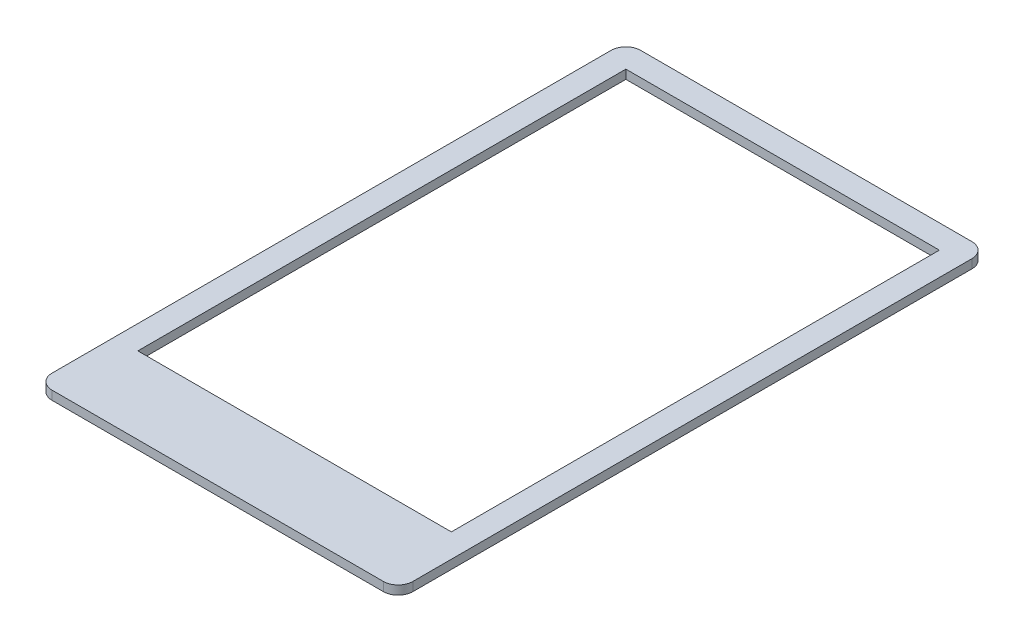
ISO-10303-21;
HEADER;
FILE_DESCRIPTION(('STEP AP214'),'2;1');
FILE_NAME('part.step','',(''),(''),'','','');
FILE_SCHEMA(('AUTOMOTIVE_DESIGN { 1 0 10303 214 1 1 1 1 }'));
ENDSEC;
DATA;
#1=APPLICATION_CONTEXT('core data for automotive mechanical design processes');
#2=APPLICATION_PROTOCOL_DEFINITION('international standard','automotive_design',2000,#1);
#3=PRODUCT_CONTEXT('',#1,'mechanical');
#4=PRODUCT('Part','Part','',(#3));
#5=PRODUCT_RELATED_PRODUCT_CATEGORY('part','',(#4));
#6=PRODUCT_DEFINITION_FORMATION('','',#4);
#7=PRODUCT_DEFINITION_CONTEXT('part definition',#1,'design');
#8=PRODUCT_DEFINITION('design','',#6,#7);
#9=PRODUCT_DEFINITION_SHAPE('','',#8);
#10=(LENGTH_UNIT() NAMED_UNIT(*) SI_UNIT(.MILLI.,.METRE.));
#11=(NAMED_UNIT(*) PLANE_ANGLE_UNIT() SI_UNIT($,.RADIAN.));
#12=(NAMED_UNIT(*) SI_UNIT($,.STERADIAN.) SOLID_ANGLE_UNIT());
#13=UNCERTAINTY_MEASURE_WITH_UNIT(LENGTH_MEASURE(1.E-05),#10,'distance_accuracy_value','');
#14=(GEOMETRIC_REPRESENTATION_CONTEXT(3) GLOBAL_UNCERTAINTY_ASSIGNED_CONTEXT((#13)) GLOBAL_UNIT_ASSIGNED_CONTEXT((#10,
#11,#12)) REPRESENTATION_CONTEXT('',''));
#15=CARTESIAN_POINT('',(0.,0.,0.));
#16=DIRECTION('',(0.,0.,1.));
#17=DIRECTION('',(1.,0.,0.));
#18=AXIS2_PLACEMENT_3D('',#15,#16,#17);
#19=CARTESIAN_POINT('',(0.,-1.,0.));
#20=DIRECTION('',(0.,-1.,0.));
#21=DIRECTION('',(0.,0.,-1.));
#22=AXIS2_PLACEMENT_3D('',#19,#20,#21);
#23=PLANE('',#22);
#24=CARTESIAN_POINT('',(58.5,-1.,-84.5));
#25=DIRECTION('',(0.,1.,0.));
#26=DIRECTION('',(0.,0.,1.));
#27=AXIS2_PLACEMENT_3D('',#24,#25,#26);
#28=CIRCLE('',#27,2.);
#29=CARTESIAN_POINT('',(58.5,-1.,-82.5));
#30=VERTEX_POINT('',#29);
#31=EDGE_CURVE('E800',#30,#30,#28,.T.);
#32=ORIENTED_EDGE('',*,*,#31,.T.);
#33=EDGE_LOOP('',(#32));
#34=FACE_BOUND('',#33,.T.);
#35=CARTESIAN_POINT('',(-58.5,-1.,-84.5));
#36=DIRECTION('',(0.,1.,0.));
#37=DIRECTION('',(0.,0.,1.));
#38=AXIS2_PLACEMENT_3D('',#35,#36,#37);
#39=CIRCLE('',#38,2.);
#40=CARTESIAN_POINT('',(-58.5,-1.,-82.5));
#41=VERTEX_POINT('',#40);
#42=EDGE_CURVE('E801',#41,#41,#39,.T.);
#43=ORIENTED_EDGE('',*,*,#42,.T.);
#44=EDGE_LOOP('',(#43));
#45=FACE_BOUND('',#44,.T.);
#46=CARTESIAN_POINT('',(-58.5,-1.,0.));
#47=DIRECTION('',(0.,1.,0.));
#48=DIRECTION('',(0.,0.,1.));
#49=AXIS2_PLACEMENT_3D('',#46,#47,#48);
#50=CIRCLE('',#49,2.);
#51=CARTESIAN_POINT('',(-58.5,-1.,2.));
#52=VERTEX_POINT('',#51);
#53=EDGE_CURVE('E813',#52,#52,#50,.T.);
#54=ORIENTED_EDGE('',*,*,#53,.T.);
#55=EDGE_LOOP('',(#54));
#56=FACE_BOUND('',#55,.T.);
#57=CARTESIAN_POINT('',(-58.5,-1.,102.5));
#58=DIRECTION('',(0.,1.,0.));
#59=DIRECTION('',(0.,0.,1.));
#60=AXIS2_PLACEMENT_3D('',#57,#58,#59);
#61=CIRCLE('',#60,2.);
#62=CARTESIAN_POINT('',(-58.5,-1.,104.5));
#63=VERTEX_POINT('',#62);
#64=EDGE_CURVE('E819',#63,#63,#61,.T.);
#65=ORIENTED_EDGE('',*,*,#64,.T.);
#66=EDGE_LOOP('',(#65));
#67=FACE_BOUND('',#66,.T.);
#68=CARTESIAN_POINT('',(58.5,-1.,102.5));
#69=DIRECTION('',(0.,1.,0.));
#70=DIRECTION('',(0.,0.,1.));
#71=AXIS2_PLACEMENT_3D('',#68,#69,#70);
#72=CIRCLE('',#71,2.);
#73=CARTESIAN_POINT('',(58.5,-1.,104.5));
#74=VERTEX_POINT('',#73);
#75=EDGE_CURVE('E825',#74,#74,#72,.T.);
#76=ORIENTED_EDGE('',*,*,#75,.T.);
#77=EDGE_LOOP('',(#76));
#78=FACE_BOUND('',#77,.T.);
#79=CARTESIAN_POINT('',(58.5,-1.,0.));
#80=DIRECTION('',(0.,1.,0.));
#81=DIRECTION('',(0.,0.,1.));
#82=AXIS2_PLACEMENT_3D('',#79,#80,#81);
#83=CIRCLE('',#82,2.);
#84=CARTESIAN_POINT('',(58.5,-1.,2.));
#85=VERTEX_POINT('',#84);
#86=EDGE_CURVE('E231',#85,#85,#83,.T.);
#87=ORIENTED_EDGE('',*,*,#86,.T.);
#88=EDGE_LOOP('',(#87));
#89=FACE_BOUND('',#88,.T.);
#90=CARTESIAN_POINT('',(-56.,-1.,-85.5));
#91=DIRECTION('',(0.,-1.,0.));
#92=DIRECTION('',(0.,0.,-1.));
#93=AXIS2_PLACEMENT_3D('',#90,#91,#92);
#94=CIRCLE('',#93,5.00000000000002);
#95=CARTESIAN_POINT('',(-56.,-1.,-90.5));
#96=VERTEX_POINT('',#95);
#97=CARTESIAN_POINT('',(-61.,-1.,-85.5));
#98=VERTEX_POINT('',#97);
#99=EDGE_CURVE('E366',#96,#98,#94,.F.);
#100=ORIENTED_EDGE('',*,*,#99,.F.);
#101=DIRECTION('',(-1.,0.,0.));
#102=VECTOR('',#101,1.);
#103=CARTESIAN_POINT('',(56.,-1.,-90.5));
#104=LINE('',#103,#102);
#105=CARTESIAN_POINT('',(56.,-1.,-90.5));
#106=VERTEX_POINT('',#105);
#107=EDGE_CURVE('E364',#106,#96,#104,.T.);
#108=ORIENTED_EDGE('',*,*,#107,.F.);
#109=CARTESIAN_POINT('',(56.,-1.,-85.5));
#110=DIRECTION('',(0.,-1.,0.));
#111=DIRECTION('',(0.,0.,-1.));
#112=AXIS2_PLACEMENT_3D('',#109,#110,#111);
#113=CIRCLE('',#112,5.);
#114=CARTESIAN_POINT('',(61.,-1.,-85.5));
#115=VERTEX_POINT('',#114);
#116=EDGE_CURVE('E362',#115,#106,#113,.F.);
#117=ORIENTED_EDGE('',*,*,#116,.F.);
#118=DIRECTION('',(0.,0.,-1.));
#119=VECTOR('',#118,1.);
#120=CARTESIAN_POINT('',(61.,-1.,85.5));
#121=LINE('',#120,#119);
#122=CARTESIAN_POINT('',(61.,-1.,103.5));
#123=VERTEX_POINT('',#122);
#124=EDGE_CURVE('E360',#123,#115,#121,.T.);
#125=ORIENTED_EDGE('',*,*,#124,.F.);
#126=CARTESIAN_POINT('',(56.,-1.,103.5));
#127=DIRECTION('',(0.,-1.,0.));
#128=DIRECTION('',(0.,0.,-1.));
#129=AXIS2_PLACEMENT_3D('',#126,#127,#128);
#130=CIRCLE('',#129,5.);
#131=CARTESIAN_POINT('',(56.,-1.,108.5));
#132=VERTEX_POINT('',#131);
#133=EDGE_CURVE('E358',#132,#123,#130,.F.);
#134=ORIENTED_EDGE('',*,*,#133,.F.);
#135=DIRECTION('',(1.,0.,0.));
#136=VECTOR('',#135,1.);
#137=CARTESIAN_POINT('',(-56.,-1.,108.5));
#138=LINE('',#137,#136);
#139=CARTESIAN_POINT('',(-56.,-1.,108.5));
#140=VERTEX_POINT('',#139);
#141=EDGE_CURVE('E356',#140,#132,#138,.T.);
#142=ORIENTED_EDGE('',*,*,#141,.F.);
#143=CARTESIAN_POINT('',(-56.,-1.,103.5));
#144=DIRECTION('',(0.,-1.,0.));
#145=DIRECTION('',(0.,0.,-1.));
#146=AXIS2_PLACEMENT_3D('',#143,#144,#145);
#147=CIRCLE('',#146,5.);
#148=CARTESIAN_POINT('',(-61.,-1.,103.5));
#149=VERTEX_POINT('',#148);
#150=EDGE_CURVE('E353',#149,#140,#147,.F.);
#151=ORIENTED_EDGE('',*,*,#150,.F.);
#152=DIRECTION('',(0.,0.,-1.));
#153=VECTOR('',#152,1.);
#154=CARTESIAN_POINT('',(-61.,-1.,-80.5));
#155=LINE('',#154,#153);
#156=EDGE_CURVE('E299',#149,#98,#155,.T.);
#157=ORIENTED_EDGE('',*,*,#156,.T.);
#158=EDGE_LOOP('',(#100,#108,#117,#125,#134,#142,#151,#157));
#159=FACE_BOUND('',#158,.T.);
#160=DIRECTION('',(0.,0.,-1.));
#161=VECTOR('',#160,1.);
#162=CARTESIAN_POINT('',(53.,-1.,82.5));
#163=LINE('',#162,#161);
#164=CARTESIAN_POINT('',(53.,-1.,82.5));
#165=VERTEX_POINT('',#164);
#166=CARTESIAN_POINT('',(53.,-1.,-82.5));
#167=VERTEX_POINT('',#166);
#168=EDGE_CURVE('E328',#165,#167,#163,.T.);
#169=ORIENTED_EDGE('',*,*,#168,.T.);
#170=DIRECTION('',(-1.,0.,0.));
#171=VECTOR('',#170,1.);
#172=CARTESIAN_POINT('',(53.,-1.,-82.5));
#173=LINE('',#172,#171);
#174=CARTESIAN_POINT('',(-53.,-1.,-82.5));
#175=VERTEX_POINT('',#174);
#176=EDGE_CURVE('E338',#167,#175,#173,.T.);
#177=ORIENTED_EDGE('',*,*,#176,.T.);
#178=DIRECTION('',(0.,0.,1.));
#179=VECTOR('',#178,1.);
#180=CARTESIAN_POINT('',(-53.,-1.,-82.5));
#181=LINE('',#180,#179);
#182=CARTESIAN_POINT('',(-53.,-1.,82.5));
#183=VERTEX_POINT('',#182);
#184=EDGE_CURVE('E348',#175,#183,#181,.T.);
#185=ORIENTED_EDGE('',*,*,#184,.T.);
#186=DIRECTION('',(1.,0.,0.));
#187=VECTOR('',#186,1.);
#188=CARTESIAN_POINT('',(-53.,-1.,82.5));
#189=LINE('',#188,#187);
#190=EDGE_CURVE('E345',#183,#165,#189,.T.);
#191=ORIENTED_EDGE('',*,*,#190,.T.);
#192=EDGE_LOOP('',(#169,#177,#185,#191));
#193=FACE_BOUND('',#192,.T.);
#194=DIRECTION('',(-1.,0.,0.));
#195=VECTOR('',#194,1.);
#196=CARTESIAN_POINT('',(-15.5,-1.,106.));
#197=LINE('',#196,#195);
#198=CARTESIAN_POINT('',(15.5,-1.,106.));
#199=VERTEX_POINT('',#198);
#200=CARTESIAN_POINT('',(-15.5,-1.,106.));
#201=VERTEX_POINT('',#200);
#202=EDGE_CURVE('E273',#199,#201,#197,.T.);
#203=ORIENTED_EDGE('',*,*,#202,.F.);
#204=DIRECTION('',(0.,0.,1.));
#205=VECTOR('',#204,1.);
#206=CARTESIAN_POINT('',(15.5,-1.,89.));
#207=LINE('',#206,#205);
#208=CARTESIAN_POINT('',(15.5,-1.,89.));
#209=VERTEX_POINT('',#208);
#210=EDGE_CURVE('E271',#209,#199,#207,.T.);
#211=ORIENTED_EDGE('',*,*,#210,.F.);
#212=DIRECTION('',(1.,0.,0.));
#213=VECTOR('',#212,1.);
#214=CARTESIAN_POINT('',(-15.5,-1.,89.));
#215=LINE('',#214,#213);
#216=CARTESIAN_POINT('',(-15.5,-1.,89.));
#217=VERTEX_POINT('',#216);
#218=EDGE_CURVE('E279',#217,#209,#215,.T.);
#219=ORIENTED_EDGE('',*,*,#218,.F.);
#220=DIRECTION('',(0.,0.,-1.));
#221=VECTOR('',#220,1.);
#222=CARTESIAN_POINT('',(-15.5,-1.,89.));
#223=LINE('',#222,#221);
#224=EDGE_CURVE('E276',#201,#217,#223,.T.);
#225=ORIENTED_EDGE('',*,*,#224,.F.);
#226=EDGE_LOOP('',(#203,#211,#219,#225));
#227=FACE_BOUND('',#226,.T.);
#228=DIRECTION('',(0.,0.,-1.));
#229=VECTOR('',#228,1.);
#230=CARTESIAN_POINT('',(19.1,-1.,89.));
#231=LINE('',#230,#229);
#232=CARTESIAN_POINT('',(19.1,-1.,106.));
#233=VERTEX_POINT('',#232);
#234=CARTESIAN_POINT('',(19.1,-1.,89.));
#235=VERTEX_POINT('',#234);
#236=EDGE_CURVE('E244',#233,#235,#231,.T.);
#237=ORIENTED_EDGE('',*,*,#236,.F.);
#238=DIRECTION('',(-1.,0.,0.));
#239=VECTOR('',#238,1.);
#240=CARTESIAN_POINT('',(19.1,-1.,106.));
#241=LINE('',#240,#239);
#242=CARTESIAN_POINT('',(50.1,-1.,106.));
#243=VERTEX_POINT('',#242);
#244=EDGE_CURVE('E242',#243,#233,#241,.T.);
#245=ORIENTED_EDGE('',*,*,#244,.F.);
#246=DIRECTION('',(0.,0.,1.));
#247=VECTOR('',#246,1.);
#248=CARTESIAN_POINT('',(50.1,-1.,89.));
#249=LINE('',#248,#247);
#250=CARTESIAN_POINT('',(50.1,-1.,89.));
#251=VERTEX_POINT('',#250);
#252=EDGE_CURVE('E250',#251,#243,#249,.T.);
#253=ORIENTED_EDGE('',*,*,#252,.F.);
#254=DIRECTION('',(1.,0.,0.));
#255=VECTOR('',#254,1.);
#256=CARTESIAN_POINT('',(19.1,-1.,89.));
#257=LINE('',#256,#255);
#258=EDGE_CURVE('E247',#235,#251,#257,.T.);
#259=ORIENTED_EDGE('',*,*,#258,.F.);
#260=EDGE_LOOP('',(#237,#245,#253,#259));
#261=FACE_BOUND('',#260,.T.);
#262=DIRECTION('',(0.,0.,-1.));
#263=VECTOR('',#262,1.);
#264=CARTESIAN_POINT('',(-50.9,-1.,89.));
#265=LINE('',#264,#263);
#266=CARTESIAN_POINT('',(-50.9,-1.,106.));
#267=VERTEX_POINT('',#266);
#268=CARTESIAN_POINT('',(-50.9,-1.,89.));
#269=VERTEX_POINT('',#268);
#270=EDGE_CURVE('E209',#267,#269,#265,.T.);
#271=ORIENTED_EDGE('',*,*,#270,.F.);
#272=DIRECTION('',(-1.,0.,0.));
#273=VECTOR('',#272,1.);
#274=CARTESIAN_POINT('',(-50.9,-1.,106.));
#275=LINE('',#274,#273);
#276=CARTESIAN_POINT('',(-19.9,-1.,106.));
#277=VERTEX_POINT('',#276);
#278=EDGE_CURVE('E199',#277,#267,#275,.T.);
#279=ORIENTED_EDGE('',*,*,#278,.F.);
#280=DIRECTION('',(0.,0.,1.));
#281=VECTOR('',#280,1.);
#282=CARTESIAN_POINT('',(-19.9,-1.,89.));
#283=LINE('',#282,#281);
#284=CARTESIAN_POINT('',(-19.9,-1.,89.));
#285=VERTEX_POINT('',#284);
#286=EDGE_CURVE('E224',#285,#277,#283,.T.);
#287=ORIENTED_EDGE('',*,*,#286,.F.);
#288=DIRECTION('',(1.,0.,0.));
#289=VECTOR('',#288,1.);
#290=CARTESIAN_POINT('',(-50.9,-1.,89.));
#291=LINE('',#290,#289);
#292=EDGE_CURVE('E222',#269,#285,#291,.T.);
#293=ORIENTED_EDGE('',*,*,#292,.F.);
#294=EDGE_LOOP('',(#271,#279,#287,#293));
#295=FACE_BOUND('',#294,.T.);
#296=ADVANCED_FACE('F34',(#34,#45,#56,#67,#78,#89,#159,#193,#227,#261,#295),#23,.T.);
#297=CARTESIAN_POINT('',(56.,-18.,-90.5));
#298=DIRECTION('',(0.,0.,-1.));
#299=DIRECTION('',(-1.,0.,0.));
#300=AXIS2_PLACEMENT_3D('',#297,#298,#299);
#301=PLANE('',#300);
#302=DIRECTION('',(0.,1.,0.));
#303=VECTOR('',#302,1.);
#304=CARTESIAN_POINT('',(56.,-18.,-90.5));
#305=LINE('',#304,#303);
#306=CARTESIAN_POINT('',(56.,2.,-90.5));
#307=VERTEX_POINT('',#306);
#308=EDGE_CURVE('E374',#106,#307,#305,.T.);
#309=ORIENTED_EDGE('',*,*,#308,.F.);
#310=ORIENTED_EDGE('',*,*,#107,.T.);
#311=DIRECTION('',(0.,1.,0.));
#312=VECTOR('',#311,1.);
#313=CARTESIAN_POINT('',(-56.,-18.,-90.5));
#314=LINE('',#313,#312);
#315=CARTESIAN_POINT('',(-56.,2.,-90.5));
#316=VERTEX_POINT('',#315);
#317=EDGE_CURVE('E372',#96,#316,#314,.T.);
#318=ORIENTED_EDGE('',*,*,#317,.T.);
#319=DIRECTION('',(-1.,0.,0.));
#320=VECTOR('',#319,1.);
#321=CARTESIAN_POINT('',(56.,2.,-90.5));
#322=LINE('',#321,#320);
#323=EDGE_CURVE('E306',#307,#316,#322,.T.);
#324=ORIENTED_EDGE('',*,*,#323,.F.);
#325=EDGE_LOOP('',(#309,#310,#318,#324));
#326=FACE_BOUND('',#325,.T.);
#327=ADVANCED_FACE('F405',(#326),#301,.T.);
#328=CARTESIAN_POINT('',(56.,-18.,-85.5));
#329=DIRECTION('',(0.,1.,0.));
#330=DIRECTION('',(0.,0.,1.));
#331=AXIS2_PLACEMENT_3D('',#328,#329,#330);
#332=CYLINDRICAL_SURFACE('',#331,5.);
#333=DIRECTION('',(0.,1.,0.));
#334=VECTOR('',#333,1.);
#335=CARTESIAN_POINT('',(61.,-18.,-85.5));
#336=LINE('',#335,#334);
#337=CARTESIAN_POINT('',(61.,2.,-85.5));
#338=VERTEX_POINT('',#337);
#339=EDGE_CURVE('E376',#115,#338,#336,.T.);
#340=ORIENTED_EDGE('',*,*,#339,.F.);
#341=ORIENTED_EDGE('',*,*,#116,.T.);
#342=ORIENTED_EDGE('',*,*,#308,.T.);
#343=CARTESIAN_POINT('',(56.,2.,-85.5));
#344=DIRECTION('',(0.,1.,0.));
#345=DIRECTION('',(0.,0.,-1.));
#346=AXIS2_PLACEMENT_3D('',#343,#344,#345);
#347=CIRCLE('',#346,5.);
#348=EDGE_CURVE('E309',#338,#307,#347,.T.);
#349=ORIENTED_EDGE('',*,*,#348,.F.);
#350=EDGE_LOOP('',(#340,#341,#342,#349));
#351=FACE_BOUND('',#350,.T.);
#352=ADVANCED_FACE('F407',(#351),#332,.T.);
#353=CARTESIAN_POINT('',(61.,-18.,85.5));
#354=DIRECTION('',(1.,0.,0.));
#355=DIRECTION('',(0.,0.,-1.));
#356=AXIS2_PLACEMENT_3D('',#353,#354,#355);
#357=PLANE('',#356);
#358=DIRECTION('',(0.,1.,0.));
#359=VECTOR('',#358,1.);
#360=CARTESIAN_POINT('',(61.,-18.,103.5));
#361=LINE('',#360,#359);
#362=CARTESIAN_POINT('',(61.,2.,103.5));
#363=VERTEX_POINT('',#362);
#364=EDGE_CURVE('E378',#123,#363,#361,.T.);
#365=ORIENTED_EDGE('',*,*,#364,.F.);
#366=ORIENTED_EDGE('',*,*,#124,.T.);
#367=ORIENTED_EDGE('',*,*,#339,.T.);
#368=DIRECTION('',(0.,0.,-1.));
#369=VECTOR('',#368,1.);
#370=CARTESIAN_POINT('',(61.,2.,85.5));
#371=LINE('',#370,#369);
#372=EDGE_CURVE('E312',#363,#338,#371,.T.);
#373=ORIENTED_EDGE('',*,*,#372,.F.);
#374=EDGE_LOOP('',(#365,#366,#367,#373));
#375=FACE_BOUND('',#374,.T.);
#376=ADVANCED_FACE('F414',(#375),#357,.T.);
#377=CARTESIAN_POINT('',(56.,-18.,103.5));
#378=DIRECTION('',(0.,1.,0.));
#379=DIRECTION('',(0.,0.,1.));
#380=AXIS2_PLACEMENT_3D('',#377,#378,#379);
#381=CYLINDRICAL_SURFACE('',#380,5.);
#382=DIRECTION('',(0.,1.,0.));
#383=VECTOR('',#382,1.);
#384=CARTESIAN_POINT('',(56.,-18.,108.5));
#385=LINE('',#384,#383);
#386=CARTESIAN_POINT('',(56.,2.,108.5));
#387=VERTEX_POINT('',#386);
#388=EDGE_CURVE('E380',#132,#387,#385,.T.);
#389=ORIENTED_EDGE('',*,*,#388,.F.);
#390=ORIENTED_EDGE('',*,*,#133,.T.);
#391=ORIENTED_EDGE('',*,*,#364,.T.);
#392=CARTESIAN_POINT('',(56.,2.,103.5));
#393=DIRECTION('',(0.,1.,0.));
#394=DIRECTION('',(0.,0.,-1.));
#395=AXIS2_PLACEMENT_3D('',#392,#393,#394);
#396=CIRCLE('',#395,5.);
#397=EDGE_CURVE('E315',#387,#363,#396,.T.);
#398=ORIENTED_EDGE('',*,*,#397,.F.);
#399=EDGE_LOOP('',(#389,#390,#391,#398));
#400=FACE_BOUND('',#399,.T.);
#401=ADVANCED_FACE('F424',(#400),#381,.T.);
#402=CARTESIAN_POINT('',(-56.,-18.,108.5));
#403=DIRECTION('',(0.,0.,1.));
#404=DIRECTION('',(1.,0.,0.));
#405=AXIS2_PLACEMENT_3D('',#402,#403,#404);
#406=PLANE('',#405);
#407=DIRECTION('',(0.,1.,0.));
#408=VECTOR('',#407,1.);
#409=CARTESIAN_POINT('',(-56.,-18.,108.5));
#410=LINE('',#409,#408);
#411=CARTESIAN_POINT('',(-56.,2.,108.5));
#412=VERTEX_POINT('',#411);
#413=EDGE_CURVE('E381',#140,#412,#410,.T.);
#414=ORIENTED_EDGE('',*,*,#413,.F.);
#415=ORIENTED_EDGE('',*,*,#141,.T.);
#416=ORIENTED_EDGE('',*,*,#388,.T.);
#417=DIRECTION('',(1.,0.,0.));
#418=VECTOR('',#417,1.);
#419=CARTESIAN_POINT('',(-56.,2.,108.5));
#420=LINE('',#419,#418);
#421=EDGE_CURVE('E318',#412,#387,#420,.T.);
#422=ORIENTED_EDGE('',*,*,#421,.F.);
#423=EDGE_LOOP('',(#414,#415,#416,#422));
#424=FACE_BOUND('',#423,.T.);
#425=ADVANCED_FACE('F428',(#424),#406,.T.);
#426=CARTESIAN_POINT('',(-56.,-18.,-85.5));
#427=DIRECTION('',(0.,1.,0.));
#428=DIRECTION('',(0.,0.,1.));
#429=AXIS2_PLACEMENT_3D('',#426,#427,#428);
#430=CYLINDRICAL_SURFACE('',#429,5.00000000000002);
#431=ORIENTED_EDGE('',*,*,#317,.F.);
#432=ORIENTED_EDGE('',*,*,#99,.T.);
#433=DIRECTION('',(0.,1.,0.));
#434=VECTOR('',#433,1.);
#435=CARTESIAN_POINT('',(-61.,-18.,-85.5));
#436=LINE('',#435,#434);
#437=CARTESIAN_POINT('',(-61.,2.,-85.5));
#438=VERTEX_POINT('',#437);
#439=EDGE_CURVE('E355',#98,#438,#436,.T.);
#440=ORIENTED_EDGE('',*,*,#439,.T.);
#441=CARTESIAN_POINT('',(-56.,2.,-85.5));
#442=DIRECTION('',(0.,1.,0.));
#443=DIRECTION('',(0.,0.,-1.));
#444=AXIS2_PLACEMENT_3D('',#441,#442,#443);
#445=CIRCLE('',#444,5.00000000000002);
#446=EDGE_CURVE('E303',#316,#438,#445,.T.);
#447=ORIENTED_EDGE('',*,*,#446,.F.);
#448=EDGE_LOOP('',(#431,#432,#440,#447));
#449=FACE_BOUND('',#448,.T.);
#450=ADVANCED_FACE('F431',(#449),#430,.T.);
#451=CARTESIAN_POINT('',(53.,-1.,82.5));
#452=DIRECTION('',(1.,0.,0.));
#453=DIRECTION('',(0.,0.,-1.));
#454=AXIS2_PLACEMENT_3D('',#451,#452,#453);
#455=PLANE('',#454);
#456=DIRECTION('',(0.,0.,-1.));
#457=VECTOR('',#456,1.);
#458=CARTESIAN_POINT('',(53.,2.,82.5));
#459=LINE('',#458,#457);
#460=CARTESIAN_POINT('',(53.,2.,82.5));
#461=VERTEX_POINT('',#460);
#462=CARTESIAN_POINT('',(53.,2.,-82.5));
#463=VERTEX_POINT('',#462);
#464=EDGE_CURVE('E334',#461,#463,#459,.T.);
#465=ORIENTED_EDGE('',*,*,#464,.T.);
#466=DIRECTION('',(0.,1.,0.));
#467=VECTOR('',#466,1.);
#468=CARTESIAN_POINT('',(53.,-1.,-82.5));
#469=LINE('',#468,#467);
#470=EDGE_CURVE('E324',#167,#463,#469,.T.);
#471=ORIENTED_EDGE('',*,*,#470,.F.);
#472=ORIENTED_EDGE('',*,*,#168,.F.);
#473=DIRECTION('',(0.,1.,0.));
#474=VECTOR('',#473,1.);
#475=CARTESIAN_POINT('',(53.,-1.,82.5));
#476=LINE('',#475,#474);
#477=EDGE_CURVE('E331',#165,#461,#476,.T.);
#478=ORIENTED_EDGE('',*,*,#477,.T.);
#479=EDGE_LOOP('',(#465,#471,#472,#478));
#480=FACE_BOUND('',#479,.T.);
#481=ADVANCED_FACE('F434',(#480),#455,.F.);
#482=CARTESIAN_POINT('',(53.,-1.,-82.5));
#483=DIRECTION('',(0.,0.,-1.));
#484=DIRECTION('',(-1.,0.,0.));
#485=AXIS2_PLACEMENT_3D('',#482,#483,#484);
#486=PLANE('',#485);
#487=DIRECTION('',(-1.,0.,0.));
#488=VECTOR('',#487,1.);
#489=CARTESIAN_POINT('',(53.,2.,-82.5));
#490=LINE('',#489,#488);
#491=CARTESIAN_POINT('',(-53.,2.,-82.5));
#492=VERTEX_POINT('',#491);
#493=EDGE_CURVE('E11',#463,#492,#490,.T.);
#494=ORIENTED_EDGE('',*,*,#493,.T.);
#495=DIRECTION('',(0.,1.,0.));
#496=VECTOR('',#495,1.);
#497=CARTESIAN_POINT('',(-53.,-1.,-82.5));
#498=LINE('',#497,#496);
#499=EDGE_CURVE('E325',#175,#492,#498,.T.);
#500=ORIENTED_EDGE('',*,*,#499,.F.);
#501=ORIENTED_EDGE('',*,*,#176,.F.);
#502=ORIENTED_EDGE('',*,*,#470,.T.);
#503=EDGE_LOOP('',(#494,#500,#501,#502));
#504=FACE_BOUND('',#503,.T.);
#505=ADVANCED_FACE('F439',(#504),#486,.F.);
#506=CARTESIAN_POINT('',(-53.,-1.,82.5));
#507=DIRECTION('',(0.,0.,1.));
#508=DIRECTION('',(1.,0.,0.));
#509=AXIS2_PLACEMENT_3D('',#506,#507,#508);
#510=PLANE('',#509);
#511=DIRECTION('',(1.,0.,0.));
#512=VECTOR('',#511,1.);
#513=CARTESIAN_POINT('',(-53.,2.,82.5));
#514=LINE('',#513,#512);
#515=CARTESIAN_POINT('',(-53.,2.,82.5));
#516=VERTEX_POINT('',#515);
#517=EDGE_CURVE('E337',#516,#461,#514,.T.);
#518=ORIENTED_EDGE('',*,*,#517,.T.);
#519=ORIENTED_EDGE('',*,*,#477,.F.);
#520=ORIENTED_EDGE('',*,*,#190,.F.);
#521=DIRECTION('',(0.,1.,0.));
#522=VECTOR('',#521,1.);
#523=CARTESIAN_POINT('',(-53.,-1.,82.5));
#524=LINE('',#523,#522);
#525=EDGE_CURVE('E329',#183,#516,#524,.T.);
#526=ORIENTED_EDGE('',*,*,#525,.T.);
#527=EDGE_LOOP('',(#518,#519,#520,#526));
#528=FACE_BOUND('',#527,.T.);
#529=ADVANCED_FACE('F509',(#528),#510,.F.);
#530=CARTESIAN_POINT('',(-56.,2.,103.5));
#531=DIRECTION('',(0.,1.,0.));
#532=DIRECTION('',(0.,0.,1.));
#533=AXIS2_PLACEMENT_3D('',#530,#531,#532);
#534=PLANE('',#533);
#535=DIRECTION('',(0.,0.,1.));
#536=VECTOR('',#535,1.);
#537=CARTESIAN_POINT('',(-61.,2.,-85.5));
#538=LINE('',#537,#536);
#539=CARTESIAN_POINT('',(-61.,2.,103.5));
#540=VERTEX_POINT('',#539);
#541=EDGE_CURVE('E300',#438,#540,#538,.T.);
#542=ORIENTED_EDGE('',*,*,#541,.T.);
#543=CARTESIAN_POINT('',(-56.,2.,103.5));
#544=DIRECTION('',(0.,1.,0.));
#545=DIRECTION('',(0.,0.,1.));
#546=AXIS2_PLACEMENT_3D('',#543,#544,#545);
#547=CIRCLE('',#546,5.);
#548=EDGE_CURVE('E321',#540,#412,#547,.T.);
#549=ORIENTED_EDGE('',*,*,#548,.T.);
#550=ORIENTED_EDGE('',*,*,#421,.T.);
#551=ORIENTED_EDGE('',*,*,#397,.T.);
#552=ORIENTED_EDGE('',*,*,#372,.T.);
#553=ORIENTED_EDGE('',*,*,#348,.T.);
#554=ORIENTED_EDGE('',*,*,#323,.T.);
#555=ORIENTED_EDGE('',*,*,#446,.T.);
#556=EDGE_LOOP('',(#542,#549,#550,#551,#552,#553,#554,#555));
#557=FACE_BOUND('',#556,.T.);
#558=ORIENTED_EDGE('',*,*,#493,.F.);
#559=ORIENTED_EDGE('',*,*,#464,.F.);
#560=ORIENTED_EDGE('',*,*,#517,.F.);
#561=DIRECTION('',(0.,0.,1.));
#562=VECTOR('',#561,1.);
#563=CARTESIAN_POINT('',(-53.,2.,-82.5));
#564=LINE('',#563,#562);
#565=EDGE_CURVE('E43',#492,#516,#564,.T.);
#566=ORIENTED_EDGE('',*,*,#565,.F.);
#567=EDGE_LOOP('',(#558,#559,#560,#566));
#568=FACE_BOUND('',#567,.T.);
#569=ADVANCED_FACE('F391',(#557,#568),#534,.T.);
#570=CARTESIAN_POINT('',(-53.,-1.,-82.5));
#571=DIRECTION('',(-1.,0.,0.));
#572=DIRECTION('',(0.,0.,1.));
#573=AXIS2_PLACEMENT_3D('',#570,#571,#572);
#574=PLANE('',#573);
#575=ORIENTED_EDGE('',*,*,#565,.T.);
#576=ORIENTED_EDGE('',*,*,#525,.F.);
#577=ORIENTED_EDGE('',*,*,#184,.F.);
#578=ORIENTED_EDGE('',*,*,#499,.T.);
#579=EDGE_LOOP('',(#575,#576,#577,#578));
#580=FACE_BOUND('',#579,.T.);
#581=ADVANCED_FACE('F396',(#580),#574,.F.);
#582=CARTESIAN_POINT('',(-56.,-18.,103.5));
#583=DIRECTION('',(0.,1.,0.));
#584=DIRECTION('',(0.,0.,1.));
#585=AXIS2_PLACEMENT_3D('',#582,#583,#584);
#586=CYLINDRICAL_SURFACE('',#585,5.);
#587=DIRECTION('',(0.,1.,0.));
#588=VECTOR('',#587,1.);
#589=CARTESIAN_POINT('',(-61.,-18.,103.5));
#590=LINE('',#589,#588);
#591=EDGE_CURVE('E38',#149,#540,#590,.T.);
#592=ORIENTED_EDGE('',*,*,#591,.F.);
#593=ORIENTED_EDGE('',*,*,#150,.T.);
#594=ORIENTED_EDGE('',*,*,#413,.T.);
#595=ORIENTED_EDGE('',*,*,#548,.F.);
#596=EDGE_LOOP('',(#592,#593,#594,#595));
#597=FACE_BOUND('',#596,.T.);
#598=ADVANCED_FACE('F394',(#597),#586,.T.);
#599=CARTESIAN_POINT('',(-61.,7.08304597359457,-80.5));
#600=DIRECTION('',(1.,0.,0.));
#601=DIRECTION('',(0.,0.,-1.));
#602=AXIS2_PLACEMENT_3D('',#599,#600,#601);
#603=PLANE('',#602);
#604=ORIENTED_EDGE('',*,*,#156,.F.);
#605=ORIENTED_EDGE('',*,*,#591,.T.);
#606=ORIENTED_EDGE('',*,*,#541,.F.);
#607=ORIENTED_EDGE('',*,*,#439,.F.);
#608=EDGE_LOOP('',(#604,#605,#606,#607));
#609=FACE_BOUND('',#608,.T.);
#610=ADVANCED_FACE('F36',(#609),#603,.F.);
#611=CARTESIAN_POINT('',(15.5,-1.,89.));
#612=DIRECTION('',(-1.,0.,0.));
#613=DIRECTION('',(0.,-1.,0.));
#614=AXIS2_PLACEMENT_3D('',#611,#612,#613);
#615=PLANE('',#614);
#616=DIRECTION('',(0.,0.,1.));
#617=VECTOR('',#616,1.);
#618=CARTESIAN_POINT('',(15.5,0.,89.));
#619=LINE('',#618,#617);
#620=CARTESIAN_POINT('',(15.5,0.,89.));
#621=VERTEX_POINT('',#620);
#622=CARTESIAN_POINT('',(15.5,0.,106.));
#623=VERTEX_POINT('',#622);
#624=EDGE_CURVE('E270',#621,#623,#619,.T.);
#625=ORIENTED_EDGE('',*,*,#624,.F.);
#626=DIRECTION('',(0.,1.,0.));
#627=VECTOR('',#626,1.);
#628=CARTESIAN_POINT('',(15.5,-1.,89.));
#629=LINE('',#628,#627);
#630=EDGE_CURVE('E51',#209,#621,#629,.T.);
#631=ORIENTED_EDGE('',*,*,#630,.F.);
#632=ORIENTED_EDGE('',*,*,#210,.T.);
#633=DIRECTION('',(0.,1.,0.));
#634=VECTOR('',#633,1.);
#635=CARTESIAN_POINT('',(15.5,-1.,106.));
#636=LINE('',#635,#634);
#637=EDGE_CURVE('E296',#199,#623,#636,.T.);
#638=ORIENTED_EDGE('',*,*,#637,.T.);
#639=EDGE_LOOP('',(#625,#631,#632,#638));
#640=FACE_BOUND('',#639,.T.);
#641=ADVANCED_FACE('F401',(#640),#615,.T.);
#642=CARTESIAN_POINT('',(-15.5,-1.,106.));
#643=DIRECTION('',(0.,0.,-1.));
#644=DIRECTION('',(-1.,0.,0.));
#645=AXIS2_PLACEMENT_3D('',#642,#643,#644);
#646=PLANE('',#645);
#647=DIRECTION('',(-1.,0.,0.));
#648=VECTOR('',#647,1.);
#649=CARTESIAN_POINT('',(-15.5,0.,106.));
#650=LINE('',#649,#648);
#651=CARTESIAN_POINT('',(-15.5,0.,106.));
#652=VERTEX_POINT('',#651);
#653=EDGE_CURVE('E283',#623,#652,#650,.T.);
#654=ORIENTED_EDGE('',*,*,#653,.F.);
#655=ORIENTED_EDGE('',*,*,#637,.F.);
#656=ORIENTED_EDGE('',*,*,#202,.T.);
#657=DIRECTION('',(0.,1.,0.));
#658=VECTOR('',#657,1.);
#659=CARTESIAN_POINT('',(-15.5,-1.,106.));
#660=LINE('',#659,#658);
#661=EDGE_CURVE('E294',#201,#652,#660,.T.);
#662=ORIENTED_EDGE('',*,*,#661,.T.);
#663=EDGE_LOOP('',(#654,#655,#656,#662));
#664=FACE_BOUND('',#663,.T.);
#665=ADVANCED_FACE('F499',(#664),#646,.T.);
#666=CARTESIAN_POINT('',(-15.5,-1.,89.));
#667=DIRECTION('',(1.,0.,0.));
#668=DIRECTION('',(0.,0.,-1.));
#669=AXIS2_PLACEMENT_3D('',#666,#667,#668);
#670=PLANE('',#669);
#671=DIRECTION('',(0.,0.,-1.));
#672=VECTOR('',#671,1.);
#673=CARTESIAN_POINT('',(-15.5,0.,89.));
#674=LINE('',#673,#672);
#675=CARTESIAN_POINT('',(-15.5,0.,89.));
#676=VERTEX_POINT('',#675);
#677=EDGE_CURVE('E286',#652,#676,#674,.T.);
#678=ORIENTED_EDGE('',*,*,#677,.F.);
#679=ORIENTED_EDGE('',*,*,#661,.F.);
#680=ORIENTED_EDGE('',*,*,#224,.T.);
#681=DIRECTION('',(0.,1.,0.));
#682=VECTOR('',#681,1.);
#683=CARTESIAN_POINT('',(-15.5,-1.,89.));
#684=LINE('',#683,#682);
#685=EDGE_CURVE('E292',#217,#676,#684,.T.);
#686=ORIENTED_EDGE('',*,*,#685,.T.);
#687=EDGE_LOOP('',(#678,#679,#680,#686));
#688=FACE_BOUND('',#687,.T.);
#689=ADVANCED_FACE('F496',(#688),#670,.T.);
#690=CARTESIAN_POINT('',(-15.5,-1.,89.));
#691=DIRECTION('',(0.,0.,1.));
#692=DIRECTION('',(1.,0.,0.));
#693=AXIS2_PLACEMENT_3D('',#690,#691,#692);
#694=PLANE('',#693);
#695=DIRECTION('',(1.,0.,0.));
#696=VECTOR('',#695,1.);
#697=CARTESIAN_POINT('',(-15.5,0.,89.));
#698=LINE('',#697,#696);
#699=EDGE_CURVE('E274',#676,#621,#698,.T.);
#700=ORIENTED_EDGE('',*,*,#699,.F.);
#701=ORIENTED_EDGE('',*,*,#685,.F.);
#702=ORIENTED_EDGE('',*,*,#218,.T.);
#703=ORIENTED_EDGE('',*,*,#630,.T.);
#704=EDGE_LOOP('',(#700,#701,#702,#703));
#705=FACE_BOUND('',#704,.T.);
#706=ADVANCED_FACE('F493',(#705),#694,.T.);
#707=CARTESIAN_POINT('',(19.1,-1.,106.));
#708=DIRECTION('',(0.,0.,-1.));
#709=DIRECTION('',(-1.,0.,0.));
#710=AXIS2_PLACEMENT_3D('',#707,#708,#709);
#711=PLANE('',#710);
#712=DIRECTION('',(-1.,0.,0.));
#713=VECTOR('',#712,1.);
#714=CARTESIAN_POINT('',(19.1,0.,106.));
#715=LINE('',#714,#713);
#716=CARTESIAN_POINT('',(50.1,0.,106.));
#717=VERTEX_POINT('',#716);
#718=CARTESIAN_POINT('',(19.1,0.,106.));
#719=VERTEX_POINT('',#718);
#720=EDGE_CURVE('E217',#717,#719,#715,.T.);
#721=ORIENTED_EDGE('',*,*,#720,.F.);
#722=DIRECTION('',(0.,1.,0.));
#723=VECTOR('',#722,1.);
#724=CARTESIAN_POINT('',(50.1,-1.,106.));
#725=LINE('',#724,#723);
#726=EDGE_CURVE('E59',#243,#717,#725,.T.);
#727=ORIENTED_EDGE('',*,*,#726,.F.);
#728=ORIENTED_EDGE('',*,*,#244,.T.);
#729=DIRECTION('',(0.,1.,0.));
#730=VECTOR('',#729,1.);
#731=CARTESIAN_POINT('',(19.1,-1.,106.));
#732=LINE('',#731,#730);
#733=EDGE_CURVE('E267',#233,#719,#732,.T.);
#734=ORIENTED_EDGE('',*,*,#733,.T.);
#735=EDGE_LOOP('',(#721,#727,#728,#734));
#736=FACE_BOUND('',#735,.T.);
#737=ADVANCED_FACE('F477',(#736),#711,.T.);
#738=CARTESIAN_POINT('',(19.1,-1.,89.));
#739=DIRECTION('',(1.,0.,0.));
#740=DIRECTION('',(0.,0.,-1.));
#741=AXIS2_PLACEMENT_3D('',#738,#739,#740);
#742=PLANE('',#741);
#743=DIRECTION('',(0.,0.,-1.));
#744=VECTOR('',#743,1.);
#745=CARTESIAN_POINT('',(19.1,0.,89.));
#746=LINE('',#745,#744);
#747=CARTESIAN_POINT('',(19.1,0.,89.));
#748=VERTEX_POINT('',#747);
#749=EDGE_CURVE('E254',#719,#748,#746,.T.);
#750=ORIENTED_EDGE('',*,*,#749,.F.);
#751=ORIENTED_EDGE('',*,*,#733,.F.);
#752=ORIENTED_EDGE('',*,*,#236,.T.);
#753=DIRECTION('',(0.,1.,0.));
#754=VECTOR('',#753,1.);
#755=CARTESIAN_POINT('',(19.1,-1.,89.));
#756=LINE('',#755,#754);
#757=EDGE_CURVE('E265',#235,#748,#756,.T.);
#758=ORIENTED_EDGE('',*,*,#757,.T.);
#759=EDGE_LOOP('',(#750,#751,#752,#758));
#760=FACE_BOUND('',#759,.T.);
#761=ADVANCED_FACE('F470',(#760),#742,.T.);
#762=CARTESIAN_POINT('',(19.1,-1.,89.));
#763=DIRECTION('',(0.,0.,1.));
#764=DIRECTION('',(1.,0.,0.));
#765=AXIS2_PLACEMENT_3D('',#762,#763,#764);
#766=PLANE('',#765);
#767=DIRECTION('',(1.,0.,0.));
#768=VECTOR('',#767,1.);
#769=CARTESIAN_POINT('',(19.1,0.,89.));
#770=LINE('',#769,#768);
#771=CARTESIAN_POINT('',(50.1,0.,89.));
#772=VERTEX_POINT('',#771);
#773=EDGE_CURVE('E257',#748,#772,#770,.T.);
#774=ORIENTED_EDGE('',*,*,#773,.F.);
#775=ORIENTED_EDGE('',*,*,#757,.F.);
#776=ORIENTED_EDGE('',*,*,#258,.T.);
#777=DIRECTION('',(0.,1.,0.));
#778=VECTOR('',#777,1.);
#779=CARTESIAN_POINT('',(50.1,-1.,89.));
#780=LINE('',#779,#778);
#781=EDGE_CURVE('E263',#251,#772,#780,.T.);
#782=ORIENTED_EDGE('',*,*,#781,.T.);
#783=EDGE_LOOP('',(#774,#775,#776,#782));
#784=FACE_BOUND('',#783,.T.);
#785=ADVANCED_FACE('F473',(#784),#766,.T.);
#786=CARTESIAN_POINT('',(50.1,-1.,89.));
#787=DIRECTION('',(-1.,0.,0.));
#788=DIRECTION('',(0.,-1.,0.));
#789=AXIS2_PLACEMENT_3D('',#786,#787,#788);
#790=PLANE('',#789);
#791=DIRECTION('',(0.,0.,1.));
#792=VECTOR('',#791,1.);
#793=CARTESIAN_POINT('',(50.1,0.,89.));
#794=LINE('',#793,#792);
#795=EDGE_CURVE('E245',#772,#717,#794,.T.);
#796=ORIENTED_EDGE('',*,*,#795,.F.);
#797=ORIENTED_EDGE('',*,*,#781,.F.);
#798=ORIENTED_EDGE('',*,*,#252,.T.);
#799=ORIENTED_EDGE('',*,*,#726,.T.);
#800=EDGE_LOOP('',(#796,#797,#798,#799));
#801=FACE_BOUND('',#800,.T.);
#802=ADVANCED_FACE('F478',(#801),#790,.T.);
#803=CARTESIAN_POINT('',(-50.9,-1.,106.));
#804=DIRECTION('',(0.,0.,-1.));
#805=DIRECTION('',(-1.,0.,0.));
#806=AXIS2_PLACEMENT_3D('',#803,#804,#805);
#807=PLANE('',#806);
#808=DIRECTION('',(-1.,0.,0.));
#809=VECTOR('',#808,1.);
#810=CARTESIAN_POINT('',(-50.9,0.,106.));
#811=LINE('',#810,#809);
#812=CARTESIAN_POINT('',(-19.9,0.,106.));
#813=VERTEX_POINT('',#812);
#814=CARTESIAN_POINT('',(-50.9,0.,106.));
#815=VERTEX_POINT('',#814);
#816=EDGE_CURVE('E229',#813,#815,#811,.T.);
#817=ORIENTED_EDGE('',*,*,#816,.F.);
#818=DIRECTION('',(0.,1.,0.));
#819=VECTOR('',#818,1.);
#820=CARTESIAN_POINT('',(-19.9,-1.,106.));
#821=LINE('',#820,#819);
#822=EDGE_CURVE('E205',#277,#813,#821,.T.);
#823=ORIENTED_EDGE('',*,*,#822,.F.);
#824=ORIENTED_EDGE('',*,*,#278,.T.);
#825=DIRECTION('',(0.,1.,0.));
#826=VECTOR('',#825,1.);
#827=CARTESIAN_POINT('',(-50.9,-1.,106.));
#828=LINE('',#827,#826);
#829=EDGE_CURVE('E203',#267,#815,#828,.T.);
#830=ORIENTED_EDGE('',*,*,#829,.T.);
#831=EDGE_LOOP('',(#817,#823,#824,#830));
#832=FACE_BOUND('',#831,.T.);
#833=ADVANCED_FACE('F202',(#832),#807,.T.);
#834=CARTESIAN_POINT('',(-50.9,-1.,89.));
#835=DIRECTION('',(1.,0.,0.));
#836=DIRECTION('',(0.,0.,-1.));
#837=AXIS2_PLACEMENT_3D('',#834,#835,#836);
#838=PLANE('',#837);
#839=DIRECTION('',(0.,0.,-1.));
#840=VECTOR('',#839,1.);
#841=CARTESIAN_POINT('',(-50.9,0.,89.));
#842=LINE('',#841,#840);
#843=CARTESIAN_POINT('',(-50.9,0.,89.));
#844=VERTEX_POINT('',#843);
#845=EDGE_CURVE('E216',#815,#844,#842,.T.);
#846=ORIENTED_EDGE('',*,*,#845,.F.);
#847=ORIENTED_EDGE('',*,*,#829,.F.);
#848=ORIENTED_EDGE('',*,*,#270,.T.);
#849=DIRECTION('',(0.,1.,0.));
#850=VECTOR('',#849,1.);
#851=CARTESIAN_POINT('',(-50.9,-1.,89.));
#852=LINE('',#851,#850);
#853=EDGE_CURVE('E218',#269,#844,#852,.T.);
#854=ORIENTED_EDGE('',*,*,#853,.T.);
#855=EDGE_LOOP('',(#846,#847,#848,#854));
#856=FACE_BOUND('',#855,.T.);
#857=ADVANCED_FACE('F213',(#856),#838,.T.);
#858=CARTESIAN_POINT('',(-50.9,-1.,89.));
#859=DIRECTION('',(0.,0.,1.));
#860=DIRECTION('',(1.,0.,0.));
#861=AXIS2_PLACEMENT_3D('',#858,#859,#860);
#862=PLANE('',#861);
#863=DIRECTION('',(1.,0.,0.));
#864=VECTOR('',#863,1.);
#865=CARTESIAN_POINT('',(-50.9,0.,89.));
#866=LINE('',#865,#864);
#867=CARTESIAN_POINT('',(-19.9,0.,89.));
#868=VERTEX_POINT('',#867);
#869=EDGE_CURVE('E233',#844,#868,#866,.T.);
#870=ORIENTED_EDGE('',*,*,#869,.F.);
#871=ORIENTED_EDGE('',*,*,#853,.F.);
#872=ORIENTED_EDGE('',*,*,#292,.T.);
#873=DIRECTION('',(0.,1.,0.));
#874=VECTOR('',#873,1.);
#875=CARTESIAN_POINT('',(-19.9,-1.,89.));
#876=LINE('',#875,#874);
#877=EDGE_CURVE('E239',#285,#868,#876,.T.);
#878=ORIENTED_EDGE('',*,*,#877,.T.);
#879=EDGE_LOOP('',(#870,#871,#872,#878));
#880=FACE_BOUND('',#879,.T.);
#881=ADVANCED_FACE('F631',(#880),#862,.T.);
#882=CARTESIAN_POINT('',(-19.9,-1.,89.));
#883=DIRECTION('',(-1.,0.,0.));
#884=DIRECTION('',(0.,-1.,0.));
#885=AXIS2_PLACEMENT_3D('',#882,#883,#884);
#886=PLANE('',#885);
#887=DIRECTION('',(0.,0.,1.));
#888=VECTOR('',#887,1.);
#889=CARTESIAN_POINT('',(-19.9,0.,89.));
#890=LINE('',#889,#888);
#891=EDGE_CURVE('E210',#868,#813,#890,.T.);
#892=ORIENTED_EDGE('',*,*,#891,.F.);
#893=ORIENTED_EDGE('',*,*,#877,.F.);
#894=ORIENTED_EDGE('',*,*,#286,.T.);
#895=ORIENTED_EDGE('',*,*,#822,.T.);
#896=EDGE_LOOP('',(#892,#893,#894,#895));
#897=FACE_BOUND('',#896,.T.);
#898=ADVANCED_FACE('F513',(#897),#886,.T.);
#899=CARTESIAN_POINT('',(56.,0.,221.937207299898));
#900=DIRECTION('',(0.,1.,0.));
#901=DIRECTION('',(0.,0.,1.));
#902=AXIS2_PLACEMENT_3D('',#899,#900,#901);
#903=PLANE('',#902);
#904=ORIENTED_EDGE('',*,*,#891,.T.);
#905=ORIENTED_EDGE('',*,*,#816,.T.);
#906=ORIENTED_EDGE('',*,*,#845,.T.);
#907=ORIENTED_EDGE('',*,*,#869,.T.);
#908=EDGE_LOOP('',(#904,#905,#906,#907));
#909=FACE_BOUND('',#908,.T.);
#910=ADVANCED_FACE('F510',(#909),#903,.F.);
#911=ORIENTED_EDGE('',*,*,#795,.T.);
#912=ORIENTED_EDGE('',*,*,#720,.T.);
#913=ORIENTED_EDGE('',*,*,#749,.T.);
#914=ORIENTED_EDGE('',*,*,#773,.T.);
#915=EDGE_LOOP('',(#911,#912,#913,#914));
#916=FACE_BOUND('',#915,.T.);
#917=ADVANCED_FACE('F475',(#916),#903,.F.);
#918=ORIENTED_EDGE('',*,*,#699,.T.);
#919=ORIENTED_EDGE('',*,*,#624,.T.);
#920=ORIENTED_EDGE('',*,*,#653,.T.);
#921=ORIENTED_EDGE('',*,*,#677,.T.);
#922=EDGE_LOOP('',(#918,#919,#920,#921));
#923=FACE_BOUND('',#922,.T.);
#924=ADVANCED_FACE('F515',(#923),#903,.F.);
#925=CARTESIAN_POINT('',(58.5,-1.,0.));
#926=DIRECTION('',(0.,1.,0.));
#927=DIRECTION('',(0.,0.,1.));
#928=AXIS2_PLACEMENT_3D('',#925,#926,#927);
#929=CYLINDRICAL_SURFACE('',#928,2.);
#930=ORIENTED_EDGE('',*,*,#86,.F.);
#931=EDGE_LOOP('',(#930));
#932=FACE_BOUND('',#931,.T.);
#933=CARTESIAN_POINT('',(58.5,1.,0.));
#934=DIRECTION('',(0.,1.,0.));
#935=DIRECTION('',(0.,0.,1.));
#936=AXIS2_PLACEMENT_3D('',#933,#934,#935);
#937=CIRCLE('',#936,2.);
#938=CARTESIAN_POINT('',(58.5,1.,2.));
#939=VERTEX_POINT('',#938);
#940=EDGE_CURVE('E804',#939,#939,#937,.T.);
#941=ORIENTED_EDGE('',*,*,#940,.T.);
#942=EDGE_LOOP('',(#941));
#943=FACE_BOUND('',#942,.T.);
#944=ADVANCED_FACE('F673',(#932,#943),#929,.F.);
#945=CARTESIAN_POINT('',(58.5,1.,0.));
#946=DIRECTION('',(0.,1.,0.));
#947=DIRECTION('',(0.,0.,1.));
#948=AXIS2_PLACEMENT_3D('',#945,#946,#947);
#949=PLANE('',#948);
#950=ORIENTED_EDGE('',*,*,#940,.F.);
#951=EDGE_LOOP('',(#950));
#952=FACE_BOUND('',#951,.T.);
#953=ADVANCED_FACE('F683',(#952),#949,.F.);
#954=CARTESIAN_POINT('',(58.5,-1.,102.5));
#955=DIRECTION('',(0.,1.,0.));
#956=DIRECTION('',(0.,0.,1.));
#957=AXIS2_PLACEMENT_3D('',#954,#955,#956);
#958=CYLINDRICAL_SURFACE('',#957,2.);
#959=ORIENTED_EDGE('',*,*,#75,.F.);
#960=EDGE_LOOP('',(#959));
#961=FACE_BOUND('',#960,.T.);
#962=CARTESIAN_POINT('',(58.5,1.,102.5));
#963=DIRECTION('',(0.,1.,0.));
#964=DIRECTION('',(0.,0.,1.));
#965=AXIS2_PLACEMENT_3D('',#962,#963,#964);
#966=CIRCLE('',#965,2.);
#967=CARTESIAN_POINT('',(58.5,1.,104.5));
#968=VERTEX_POINT('',#967);
#969=EDGE_CURVE('E835',#968,#968,#966,.T.);
#970=ORIENTED_EDGE('',*,*,#969,.T.);
#971=EDGE_LOOP('',(#970));
#972=FACE_BOUND('',#971,.T.);
#973=ADVANCED_FACE('F693',(#961,#972),#958,.F.);
#974=CARTESIAN_POINT('',(58.5,1.,102.5));
#975=DIRECTION('',(0.,1.,0.));
#976=DIRECTION('',(0.,0.,1.));
#977=AXIS2_PLACEMENT_3D('',#974,#975,#976);
#978=PLANE('',#977);
#979=ORIENTED_EDGE('',*,*,#969,.F.);
#980=EDGE_LOOP('',(#979));
#981=FACE_BOUND('',#980,.T.);
#982=ADVANCED_FACE('F703',(#981),#978,.F.);
#983=CARTESIAN_POINT('',(-58.5,-1.,102.5));
#984=DIRECTION('',(0.,1.,0.));
#985=DIRECTION('',(0.,0.,1.));
#986=AXIS2_PLACEMENT_3D('',#983,#984,#985);
#987=CYLINDRICAL_SURFACE('',#986,2.);
#988=ORIENTED_EDGE('',*,*,#64,.F.);
#989=EDGE_LOOP('',(#988));
#990=FACE_BOUND('',#989,.T.);
#991=CARTESIAN_POINT('',(-58.5,1.,102.5));
#992=DIRECTION('',(0.,1.,0.));
#993=DIRECTION('',(0.,0.,1.));
#994=AXIS2_PLACEMENT_3D('',#991,#992,#993);
#995=CIRCLE('',#994,2.);
#996=CARTESIAN_POINT('',(-58.5,1.,104.5));
#997=VERTEX_POINT('',#996);
#998=EDGE_CURVE('E822',#997,#997,#995,.T.);
#999=ORIENTED_EDGE('',*,*,#998,.T.);
#1000=EDGE_LOOP('',(#999));
#1001=FACE_BOUND('',#1000,.T.);
#1002=ADVANCED_FACE('F713',(#990,#1001),#987,.F.);
#1003=CARTESIAN_POINT('',(-58.5,1.,102.5));
#1004=DIRECTION('',(0.,1.,0.));
#1005=DIRECTION('',(0.,0.,1.));
#1006=AXIS2_PLACEMENT_3D('',#1003,#1004,#1005);
#1007=PLANE('',#1006);
#1008=ORIENTED_EDGE('',*,*,#998,.F.);
#1009=EDGE_LOOP('',(#1008));
#1010=FACE_BOUND('',#1009,.T.);
#1011=ADVANCED_FACE('F723',(#1010),#1007,.F.);
#1012=CARTESIAN_POINT('',(-58.5,-1.,0.));
#1013=DIRECTION('',(0.,1.,0.));
#1014=DIRECTION('',(0.,0.,1.));
#1015=AXIS2_PLACEMENT_3D('',#1012,#1013,#1014);
#1016=CYLINDRICAL_SURFACE('',#1015,2.);
#1017=ORIENTED_EDGE('',*,*,#53,.F.);
#1018=EDGE_LOOP('',(#1017));
#1019=FACE_BOUND('',#1018,.T.);
#1020=CARTESIAN_POINT('',(-58.5,1.,0.));
#1021=DIRECTION('',(0.,1.,0.));
#1022=DIRECTION('',(0.,0.,1.));
#1023=AXIS2_PLACEMENT_3D('',#1020,#1021,#1022);
#1024=CIRCLE('',#1023,2.);
#1025=CARTESIAN_POINT('',(-58.5,1.,2.));
#1026=VERTEX_POINT('',#1025);
#1027=EDGE_CURVE('E816',#1026,#1026,#1024,.T.);
#1028=ORIENTED_EDGE('',*,*,#1027,.T.);
#1029=EDGE_LOOP('',(#1028));
#1030=FACE_BOUND('',#1029,.T.);
#1031=ADVANCED_FACE('F733',(#1019,#1030),#1016,.F.);
#1032=CARTESIAN_POINT('',(-58.5,1.,0.));
#1033=DIRECTION('',(0.,1.,0.));
#1034=DIRECTION('',(0.,0.,1.));
#1035=AXIS2_PLACEMENT_3D('',#1032,#1033,#1034);
#1036=PLANE('',#1035);
#1037=ORIENTED_EDGE('',*,*,#1027,.F.);
#1038=EDGE_LOOP('',(#1037));
#1039=FACE_BOUND('',#1038,.T.);
#1040=ADVANCED_FACE('F743',(#1039),#1036,.F.);
#1041=CARTESIAN_POINT('',(-58.5,-1.,-84.5));
#1042=DIRECTION('',(0.,1.,0.));
#1043=DIRECTION('',(0.,0.,1.));
#1044=AXIS2_PLACEMENT_3D('',#1041,#1042,#1043);
#1045=CYLINDRICAL_SURFACE('',#1044,2.);
#1046=ORIENTED_EDGE('',*,*,#42,.F.);
#1047=EDGE_LOOP('',(#1046));
#1048=FACE_BOUND('',#1047,.T.);
#1049=CARTESIAN_POINT('',(-58.5,1.,-84.5));
#1050=DIRECTION('',(0.,1.,0.));
#1051=DIRECTION('',(0.,0.,1.));
#1052=AXIS2_PLACEMENT_3D('',#1049,#1050,#1051);
#1053=CIRCLE('',#1052,2.);
#1054=CARTESIAN_POINT('',(-58.5,1.,-82.5));
#1055=VERTEX_POINT('',#1054);
#1056=EDGE_CURVE('E807',#1055,#1055,#1053,.T.);
#1057=ORIENTED_EDGE('',*,*,#1056,.T.);
#1058=EDGE_LOOP('',(#1057));
#1059=FACE_BOUND('',#1058,.T.);
#1060=ADVANCED_FACE('F753',(#1048,#1059),#1045,.F.);
#1061=CARTESIAN_POINT('',(-58.5,1.,-84.5));
#1062=DIRECTION('',(0.,1.,0.));
#1063=DIRECTION('',(0.,0.,1.));
#1064=AXIS2_PLACEMENT_3D('',#1061,#1062,#1063);
#1065=PLANE('',#1064);
#1066=ORIENTED_EDGE('',*,*,#1056,.F.);
#1067=EDGE_LOOP('',(#1066));
#1068=FACE_BOUND('',#1067,.T.);
#1069=ADVANCED_FACE('F763',(#1068),#1065,.F.);
#1070=CARTESIAN_POINT('',(58.5,-1.,-84.5));
#1071=DIRECTION('',(0.,1.,0.));
#1072=DIRECTION('',(0.,0.,1.));
#1073=AXIS2_PLACEMENT_3D('',#1070,#1071,#1072);
#1074=CYLINDRICAL_SURFACE('',#1073,2.);
#1075=ORIENTED_EDGE('',*,*,#31,.F.);
#1076=EDGE_LOOP('',(#1075));
#1077=FACE_BOUND('',#1076,.T.);
#1078=CARTESIAN_POINT('',(58.5,1.,-84.5));
#1079=DIRECTION('',(0.,1.,0.));
#1080=DIRECTION('',(0.,0.,1.));
#1081=AXIS2_PLACEMENT_3D('',#1078,#1079,#1080);
#1082=CIRCLE('',#1081,2.);
#1083=CARTESIAN_POINT('',(58.5,1.,-82.5));
#1084=VERTEX_POINT('',#1083);
#1085=EDGE_CURVE('E798',#1084,#1084,#1082,.T.);
#1086=ORIENTED_EDGE('',*,*,#1085,.T.);
#1087=EDGE_LOOP('',(#1086));
#1088=FACE_BOUND('',#1087,.T.);
#1089=ADVANCED_FACE('F773',(#1077,#1088),#1074,.F.);
#1090=CARTESIAN_POINT('',(58.5,1.,-84.5));
#1091=DIRECTION('',(0.,1.,0.));
#1092=DIRECTION('',(0.,0.,1.));
#1093=AXIS2_PLACEMENT_3D('',#1090,#1091,#1092);
#1094=PLANE('',#1093);
#1095=ORIENTED_EDGE('',*,*,#1085,.F.);
#1096=EDGE_LOOP('',(#1095));
#1097=FACE_BOUND('',#1096,.T.);
#1098=ADVANCED_FACE('F783',(#1097),#1094,.F.);
#1099=CLOSED_SHELL('',(#296,#327,#352,#376,#401,#425,#450,#481,#505,#529,#569,#581,#598,#610,
#641,#665,#689,#706,#737,#761,#785,#802,#833,#857,#881,#898,#910,#917,#924,#944,#953,#973,#982,
#1002,#1011,#1031,#1040,#1060,#1069,#1089,#1098));
#1100=MANIFOLD_SOLID_BREP('B2',#1099);
#1101=ADVANCED_BREP_SHAPE_REPRESENTATION('',(#18,#1100),#14);
#1102=SHAPE_DEFINITION_REPRESENTATION(#9,#1101);
ENDSEC;
END-ISO-10303-21;
